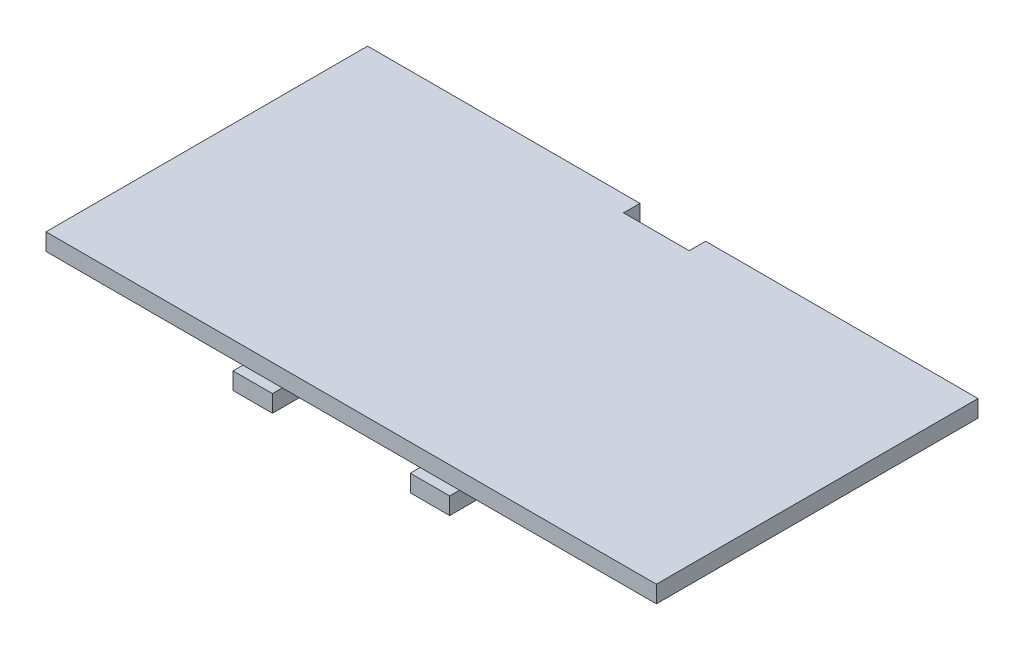
ISO-10303-21;
HEADER;
FILE_DESCRIPTION(('STEP AP214'),'2;1');
FILE_NAME('part.step','',(''),(''),'','','');
FILE_SCHEMA(('AUTOMOTIVE_DESIGN { 1 0 10303 214 1 1 1 1 }'));
ENDSEC;
DATA;
#1=APPLICATION_CONTEXT('core data for automotive mechanical design processes');
#2=APPLICATION_PROTOCOL_DEFINITION('international standard','automotive_design',2000,#1);
#3=PRODUCT_CONTEXT('',#1,'mechanical');
#4=PRODUCT('Part','Part','',(#3));
#5=PRODUCT_RELATED_PRODUCT_CATEGORY('part','',(#4));
#6=PRODUCT_DEFINITION_FORMATION('','',#4);
#7=PRODUCT_DEFINITION_CONTEXT('part definition',#1,'design');
#8=PRODUCT_DEFINITION('design','',#6,#7);
#9=PRODUCT_DEFINITION_SHAPE('','',#8);
#10=(LENGTH_UNIT() NAMED_UNIT(*) SI_UNIT(.MILLI.,.METRE.));
#11=(NAMED_UNIT(*) PLANE_ANGLE_UNIT() SI_UNIT($,.RADIAN.));
#12=(NAMED_UNIT(*) SI_UNIT($,.STERADIAN.) SOLID_ANGLE_UNIT());
#13=UNCERTAINTY_MEASURE_WITH_UNIT(LENGTH_MEASURE(1.E-05),#10,'distance_accuracy_value','');
#14=(GEOMETRIC_REPRESENTATION_CONTEXT(3) GLOBAL_UNCERTAINTY_ASSIGNED_CONTEXT((#13)) GLOBAL_UNIT_ASSIGNED_CONTEXT((#10,
#11,#12)) REPRESENTATION_CONTEXT('',''));
#15=CARTESIAN_POINT('',(0.,0.,0.));
#16=DIRECTION('',(0.,0.,1.));
#17=DIRECTION('',(1.,0.,0.));
#18=AXIS2_PLACEMENT_3D('',#15,#16,#17);
#19=CARTESIAN_POINT('',(0.,0.,0.));
#20=DIRECTION('',(0.,-1.,0.));
#21=DIRECTION('',(0.,0.,-1.));
#22=AXIS2_PLACEMENT_3D('',#19,#20,#21);
#23=PLANE('',#22);
#24=DIRECTION('',(1.,0.,0.));
#25=VECTOR('',#24,1.);
#26=CARTESIAN_POINT('',(-46.5,0.,24.5));
#27=LINE('',#26,#25);
#28=CARTESIAN_POINT('',(16.5,0.,24.5));
#29=VERTEX_POINT('',#28);
#30=CARTESIAN_POINT('',(46.5,0.,24.5));
#31=VERTEX_POINT('',#30);
#32=EDGE_CURVE('E263',#29,#31,#27,.T.);
#33=ORIENTED_EDGE('',*,*,#32,.F.);
#34=DIRECTION('',(0.,0.,1.));
#35=VECTOR('',#34,1.);
#36=CARTESIAN_POINT('',(16.5,0.,23.));
#37=LINE('',#36,#35);
#38=CARTESIAN_POINT('',(16.5,0.,21.5));
#39=VERTEX_POINT('',#38);
#40=EDGE_CURVE('E524',#39,#29,#37,.T.);
#41=ORIENTED_EDGE('',*,*,#40,.F.);
#42=DIRECTION('',(1.,0.,0.));
#43=VECTOR('',#42,1.);
#44=CARTESIAN_POINT('',(10.5,0.,21.5));
#45=LINE('',#44,#43);
#46=CARTESIAN_POINT('',(10.5,0.,21.5));
#47=VERTEX_POINT('',#46);
#48=EDGE_CURVE('E532',#47,#39,#45,.T.);
#49=ORIENTED_EDGE('',*,*,#48,.F.);
#50=DIRECTION('',(0.,0.,1.));
#51=VECTOR('',#50,1.);
#52=CARTESIAN_POINT('',(10.5,0.,0.));
#53=LINE('',#52,#51);
#54=CARTESIAN_POINT('',(10.5,0.,24.5));
#55=VERTEX_POINT('',#54);
#56=EDGE_CURVE('E11',#47,#55,#53,.T.);
#57=ORIENTED_EDGE('',*,*,#56,.T.);
#58=CARTESIAN_POINT('',(-10.5,0.,24.5));
#59=VERTEX_POINT('',#58);
#60=EDGE_CURVE('E300',#59,#55,#27,.T.);
#61=ORIENTED_EDGE('',*,*,#60,.F.);
#62=DIRECTION('',(0.,0.,1.));
#63=VECTOR('',#62,1.);
#64=CARTESIAN_POINT('',(-10.5,0.,23.));
#65=LINE('',#64,#63);
#66=CARTESIAN_POINT('',(-10.5,0.,21.5));
#67=VERTEX_POINT('',#66);
#68=EDGE_CURVE('E197',#67,#59,#65,.T.);
#69=ORIENTED_EDGE('',*,*,#68,.F.);
#70=DIRECTION('',(1.,0.,0.));
#71=VECTOR('',#70,1.);
#72=CARTESIAN_POINT('',(-16.5,0.,21.5));
#73=LINE('',#72,#71);
#74=CARTESIAN_POINT('',(-16.5,0.,21.5));
#75=VERTEX_POINT('',#74);
#76=EDGE_CURVE('E55',#75,#67,#73,.T.);
#77=ORIENTED_EDGE('',*,*,#76,.F.);
#78=DIRECTION('',(0.,0.,-1.));
#79=VECTOR('',#78,1.);
#80=CARTESIAN_POINT('',(-16.5,0.,23.));
#81=LINE('',#80,#79);
#82=CARTESIAN_POINT('',(-16.5,0.,24.5));
#83=VERTEX_POINT('',#82);
#84=EDGE_CURVE('E40',#83,#75,#81,.T.);
#85=ORIENTED_EDGE('',*,*,#84,.F.);
#86=CARTESIAN_POINT('',(-46.5,0.,24.5));
#87=VERTEX_POINT('',#86);
#88=EDGE_CURVE('E246',#87,#83,#27,.T.);
#89=ORIENTED_EDGE('',*,*,#88,.F.);
#90=DIRECTION('',(0.,0.,1.));
#91=VECTOR('',#90,1.);
#92=CARTESIAN_POINT('',(-46.5,0.,24.5));
#93=LINE('',#92,#91);
#94=CARTESIAN_POINT('',(-46.5,0.,-24.5));
#95=VERTEX_POINT('',#94);
#96=EDGE_CURVE('E261',#95,#87,#93,.T.);
#97=ORIENTED_EDGE('',*,*,#96,.F.);
#98=DIRECTION('',(-1.,0.,0.));
#99=VECTOR('',#98,1.);
#100=CARTESIAN_POINT('',(-46.5,0.,-24.5));
#101=LINE('',#100,#99);
#102=CARTESIAN_POINT('',(-5.,0.,-24.5));
#103=VERTEX_POINT('',#102);
#104=EDGE_CURVE('E257',#103,#95,#101,.T.);
#105=ORIENTED_EDGE('',*,*,#104,.F.);
#106=DIRECTION('',(0.,0.,1.));
#107=VECTOR('',#106,1.);
#108=CARTESIAN_POINT('',(-5.,0.,-24.5));
#109=LINE('',#108,#107);
#110=CARTESIAN_POINT('',(-5.,0.,-22.));
#111=VERTEX_POINT('',#110);
#112=EDGE_CURVE('E216',#103,#111,#109,.T.);
#113=ORIENTED_EDGE('',*,*,#112,.T.);
#114=DIRECTION('',(1.,0.,0.));
#115=VECTOR('',#114,1.);
#116=CARTESIAN_POINT('',(-5.,0.,-22.));
#117=LINE('',#116,#115);
#118=CARTESIAN_POINT('',(5.,0.,-22.));
#119=VERTEX_POINT('',#118);
#120=EDGE_CURVE('E219',#111,#119,#117,.T.);
#121=ORIENTED_EDGE('',*,*,#120,.T.);
#122=DIRECTION('',(0.,0.,-1.));
#123=VECTOR('',#122,1.);
#124=CARTESIAN_POINT('',(5.,0.,-24.5));
#125=LINE('',#124,#123);
#126=CARTESIAN_POINT('',(5.,0.,-24.5));
#127=VERTEX_POINT('',#126);
#128=EDGE_CURVE('E223',#119,#127,#125,.T.);
#129=ORIENTED_EDGE('',*,*,#128,.T.);
#130=CARTESIAN_POINT('',(46.5,0.,-24.5));
#131=VERTEX_POINT('',#130);
#132=EDGE_CURVE('E258',#131,#127,#101,.T.);
#133=ORIENTED_EDGE('',*,*,#132,.F.);
#134=DIRECTION('',(0.,0.,-1.));
#135=VECTOR('',#134,1.);
#136=CARTESIAN_POINT('',(46.5,0.,24.5));
#137=LINE('',#136,#135);
#138=EDGE_CURVE('E235',#31,#131,#137,.T.);
#139=ORIENTED_EDGE('',*,*,#138,.F.);
#140=EDGE_LOOP('',(#33,#41,#49,#57,#61,#69,#77,#85,#89,#97,#105,#113,#121,#129,#133,#139));
#141=FACE_BOUND('',#140,.T.);
#142=ADVANCED_FACE('F32',(#141),#23,.T.);
#143=CARTESIAN_POINT('',(-46.5,2.6,-24.5));
#144=DIRECTION('',(0.,0.,1.));
#145=DIRECTION('',(1.,0.,0.));
#146=AXIS2_PLACEMENT_3D('',#143,#144,#145);
#147=PLANE('',#146);
#148=DIRECTION('',(-1.,0.,0.));
#149=VECTOR('',#148,1.);
#150=CARTESIAN_POINT('',(-46.5,2.6,-24.5));
#151=LINE('',#150,#149);
#152=CARTESIAN_POINT('',(-5.,2.6,-24.5));
#153=VERTEX_POINT('',#152);
#154=CARTESIAN_POINT('',(-46.5,2.6,-24.5));
#155=VERTEX_POINT('',#154);
#156=EDGE_CURVE('E245',#153,#155,#151,.T.);
#157=ORIENTED_EDGE('',*,*,#156,.F.);
#158=DIRECTION('',(0.,1.,0.));
#159=VECTOR('',#158,1.);
#160=CARTESIAN_POINT('',(-5.,0.,-24.5));
#161=LINE('',#160,#159);
#162=EDGE_CURVE('E233',#103,#153,#161,.T.);
#163=ORIENTED_EDGE('',*,*,#162,.F.);
#164=ORIENTED_EDGE('',*,*,#104,.T.);
#165=DIRECTION('',(0.,-1.,0.));
#166=VECTOR('',#165,1.);
#167=CARTESIAN_POINT('',(-46.5,2.6,-24.5));
#168=LINE('',#167,#166);
#169=EDGE_CURVE('E272',#155,#95,#168,.T.);
#170=ORIENTED_EDGE('',*,*,#169,.F.);
#171=EDGE_LOOP('',(#157,#163,#164,#170));
#172=FACE_BOUND('',#171,.T.);
#173=ADVANCED_FACE('F326',(#172),#147,.F.);
#174=CARTESIAN_POINT('',(46.5,2.6,24.5));
#175=DIRECTION('',(-1.,0.,0.));
#176=DIRECTION('',(0.,0.,1.));
#177=AXIS2_PLACEMENT_3D('',#174,#175,#176);
#178=PLANE('',#177);
#179=ORIENTED_EDGE('',*,*,#138,.T.);
#180=DIRECTION('',(0.,-1.,0.));
#181=VECTOR('',#180,1.);
#182=CARTESIAN_POINT('',(46.5,2.6,-24.5));
#183=LINE('',#182,#181);
#184=CARTESIAN_POINT('',(46.5,2.6,-24.5));
#185=VERTEX_POINT('',#184);
#186=EDGE_CURVE('E274',#185,#131,#183,.T.);
#187=ORIENTED_EDGE('',*,*,#186,.F.);
#188=DIRECTION('',(0.,0.,-1.));
#189=VECTOR('',#188,1.);
#190=CARTESIAN_POINT('',(46.5,2.6,24.5));
#191=LINE('',#190,#189);
#192=CARTESIAN_POINT('',(46.5,2.6,24.5));
#193=VERTEX_POINT('',#192);
#194=EDGE_CURVE('E242',#193,#185,#191,.T.);
#195=ORIENTED_EDGE('',*,*,#194,.F.);
#196=DIRECTION('',(0.,-1.,0.));
#197=VECTOR('',#196,1.);
#198=CARTESIAN_POINT('',(46.5,2.6,24.5));
#199=LINE('',#198,#197);
#200=EDGE_CURVE('E254',#193,#31,#199,.T.);
#201=ORIENTED_EDGE('',*,*,#200,.T.);
#202=EDGE_LOOP('',(#179,#187,#195,#201));
#203=FACE_BOUND('',#202,.T.);
#204=ADVANCED_FACE('F34',(#203),#178,.F.);
#205=ORIENTED_EDGE('',*,*,#132,.T.);
#206=DIRECTION('',(0.,1.,0.));
#207=VECTOR('',#206,1.);
#208=CARTESIAN_POINT('',(5.,0.,-24.5));
#209=LINE('',#208,#207);
#210=CARTESIAN_POINT('',(5.,2.6,-24.5));
#211=VERTEX_POINT('',#210);
#212=EDGE_CURVE('E236',#127,#211,#209,.T.);
#213=ORIENTED_EDGE('',*,*,#212,.T.);
#214=EDGE_CURVE('E247',#185,#211,#151,.T.);
#215=ORIENTED_EDGE('',*,*,#214,.F.);
#216=ORIENTED_EDGE('',*,*,#186,.T.);
#217=EDGE_LOOP('',(#205,#213,#215,#216));
#218=FACE_BOUND('',#217,.T.);
#219=ADVANCED_FACE('F311',(#218),#147,.F.);
#220=CARTESIAN_POINT('',(-46.5,2.6,24.5));
#221=DIRECTION('',(1.,0.,0.));
#222=DIRECTION('',(0.,0.,-1.));
#223=AXIS2_PLACEMENT_3D('',#220,#221,#222);
#224=PLANE('',#223);
#225=ORIENTED_EDGE('',*,*,#96,.T.);
#226=DIRECTION('',(0.,-1.,0.));
#227=VECTOR('',#226,1.);
#228=CARTESIAN_POINT('',(-46.5,2.6,24.5));
#229=LINE('',#228,#227);
#230=CARTESIAN_POINT('',(-46.5,2.6,24.5));
#231=VERTEX_POINT('',#230);
#232=EDGE_CURVE('E269',#231,#87,#229,.T.);
#233=ORIENTED_EDGE('',*,*,#232,.F.);
#234=DIRECTION('',(0.,0.,1.));
#235=VECTOR('',#234,1.);
#236=CARTESIAN_POINT('',(-46.5,2.6,24.5));
#237=LINE('',#236,#235);
#238=EDGE_CURVE('E250',#155,#231,#237,.T.);
#239=ORIENTED_EDGE('',*,*,#238,.F.);
#240=ORIENTED_EDGE('',*,*,#169,.T.);
#241=EDGE_LOOP('',(#225,#233,#239,#240));
#242=FACE_BOUND('',#241,.T.);
#243=ADVANCED_FACE('F322',(#242),#224,.F.);
#244=CARTESIAN_POINT('',(-46.5,2.6,24.5));
#245=DIRECTION('',(0.,0.,-1.));
#246=DIRECTION('',(-1.,0.,0.));
#247=AXIS2_PLACEMENT_3D('',#244,#245,#246);
#248=PLANE('',#247);
#249=ORIENTED_EDGE('',*,*,#88,.T.);
#250=EDGE_CURVE('E266',#83,#59,#27,.T.);
#251=ORIENTED_EDGE('',*,*,#250,.T.);
#252=ORIENTED_EDGE('',*,*,#60,.T.);
#253=EDGE_CURVE('E301',#55,#29,#27,.T.);
#254=ORIENTED_EDGE('',*,*,#253,.T.);
#255=ORIENTED_EDGE('',*,*,#32,.T.);
#256=ORIENTED_EDGE('',*,*,#200,.F.);
#257=DIRECTION('',(1.,0.,0.));
#258=VECTOR('',#257,1.);
#259=CARTESIAN_POINT('',(-46.5,2.6,24.5));
#260=LINE('',#259,#258);
#261=EDGE_CURVE('E252',#231,#193,#260,.T.);
#262=ORIENTED_EDGE('',*,*,#261,.F.);
#263=ORIENTED_EDGE('',*,*,#232,.T.);
#264=EDGE_LOOP('',(#249,#251,#252,#254,#255,#256,#262,#263));
#265=FACE_BOUND('',#264,.T.);
#266=ADVANCED_FACE('F305',(#265),#248,.F.);
#267=CARTESIAN_POINT('',(0.,2.6,0.));
#268=DIRECTION('',(0.,-1.,0.));
#269=DIRECTION('',(0.,0.,-1.));
#270=AXIS2_PLACEMENT_3D('',#267,#268,#269);
#271=PLANE('',#270);
#272=DIRECTION('',(1.,0.,0.));
#273=VECTOR('',#272,1.);
#274=CARTESIAN_POINT('',(-5.,2.6,-22.));
#275=LINE('',#274,#273);
#276=CARTESIAN_POINT('',(-5.,2.6,-22.));
#277=VERTEX_POINT('',#276);
#278=CARTESIAN_POINT('',(5.,2.6,-22.));
#279=VERTEX_POINT('',#278);
#280=EDGE_CURVE('E229',#277,#279,#275,.T.);
#281=ORIENTED_EDGE('',*,*,#280,.F.);
#282=DIRECTION('',(0.,0.,1.));
#283=VECTOR('',#282,1.);
#284=CARTESIAN_POINT('',(-5.,2.6,-24.5));
#285=LINE('',#284,#283);
#286=EDGE_CURVE('E215',#153,#277,#285,.T.);
#287=ORIENTED_EDGE('',*,*,#286,.F.);
#288=ORIENTED_EDGE('',*,*,#156,.T.);
#289=ORIENTED_EDGE('',*,*,#238,.T.);
#290=ORIENTED_EDGE('',*,*,#261,.T.);
#291=ORIENTED_EDGE('',*,*,#194,.T.);
#292=ORIENTED_EDGE('',*,*,#214,.T.);
#293=DIRECTION('',(0.,0.,-1.));
#294=VECTOR('',#293,1.);
#295=CARTESIAN_POINT('',(5.,2.6,-24.5));
#296=LINE('',#295,#294);
#297=EDGE_CURVE('E220',#279,#211,#296,.T.);
#298=ORIENTED_EDGE('',*,*,#297,.F.);
#299=EDGE_LOOP('',(#281,#287,#288,#289,#290,#291,#292,#298));
#300=FACE_BOUND('',#299,.T.);
#301=ADVANCED_FACE('F316',(#300),#271,.F.);
#302=CARTESIAN_POINT('',(-5.,0.,-24.5));
#303=DIRECTION('',(-1.,0.,0.));
#304=DIRECTION('',(0.,0.,1.));
#305=AXIS2_PLACEMENT_3D('',#302,#303,#304);
#306=PLANE('',#305);
#307=ORIENTED_EDGE('',*,*,#286,.T.);
#308=DIRECTION('',(0.,1.,0.));
#309=VECTOR('',#308,1.);
#310=CARTESIAN_POINT('',(-5.,0.,-22.));
#311=LINE('',#310,#309);
#312=EDGE_CURVE('E226',#111,#277,#311,.T.);
#313=ORIENTED_EDGE('',*,*,#312,.F.);
#314=ORIENTED_EDGE('',*,*,#112,.F.);
#315=ORIENTED_EDGE('',*,*,#162,.T.);
#316=EDGE_LOOP('',(#307,#313,#314,#315));
#317=FACE_BOUND('',#316,.T.);
#318=ADVANCED_FACE('F330',(#317),#306,.F.);
#319=CARTESIAN_POINT('',(5.,0.,-24.5));
#320=DIRECTION('',(1.,0.,0.));
#321=DIRECTION('',(0.,0.,-1.));
#322=AXIS2_PLACEMENT_3D('',#319,#320,#321);
#323=PLANE('',#322);
#324=ORIENTED_EDGE('',*,*,#297,.T.);
#325=ORIENTED_EDGE('',*,*,#212,.F.);
#326=ORIENTED_EDGE('',*,*,#128,.F.);
#327=DIRECTION('',(0.,1.,0.));
#328=VECTOR('',#327,1.);
#329=CARTESIAN_POINT('',(5.,0.,-22.));
#330=LINE('',#329,#328);
#331=EDGE_CURVE('E239',#119,#279,#330,.T.);
#332=ORIENTED_EDGE('',*,*,#331,.T.);
#333=EDGE_LOOP('',(#324,#325,#326,#332));
#334=FACE_BOUND('',#333,.T.);
#335=ADVANCED_FACE('F335',(#334),#323,.F.);
#336=CARTESIAN_POINT('',(-5.,0.,-22.));
#337=DIRECTION('',(0.,0.,1.));
#338=DIRECTION('',(1.,0.,0.));
#339=AXIS2_PLACEMENT_3D('',#336,#337,#338);
#340=PLANE('',#339);
#341=ORIENTED_EDGE('',*,*,#280,.T.);
#342=ORIENTED_EDGE('',*,*,#331,.F.);
#343=ORIENTED_EDGE('',*,*,#120,.F.);
#344=ORIENTED_EDGE('',*,*,#312,.T.);
#345=EDGE_LOOP('',(#341,#342,#343,#344));
#346=FACE_BOUND('',#345,.T.);
#347=ADVANCED_FACE('F333',(#346),#340,.F.);
#348=CARTESIAN_POINT('',(-16.5,-2.6,21.5));
#349=DIRECTION('',(0.,0.,1.));
#350=DIRECTION('',(1.,0.,0.));
#351=AXIS2_PLACEMENT_3D('',#348,#349,#350);
#352=PLANE('',#351);
#353=ORIENTED_EDGE('',*,*,#76,.T.);
#354=DIRECTION('',(0.,1.,0.));
#355=VECTOR('',#354,1.);
#356=CARTESIAN_POINT('',(-10.5,-2.6,21.5));
#357=LINE('',#356,#355);
#358=CARTESIAN_POINT('',(-10.5,-2.6,21.5));
#359=VERTEX_POINT('',#358);
#360=EDGE_CURVE('E209',#359,#67,#357,.T.);
#361=ORIENTED_EDGE('',*,*,#360,.F.);
#362=DIRECTION('',(1.,0.,0.));
#363=VECTOR('',#362,1.);
#364=CARTESIAN_POINT('',(-16.5,-2.6,21.5));
#365=LINE('',#364,#363);
#366=CARTESIAN_POINT('',(-16.5,-2.6,21.5));
#367=VERTEX_POINT('',#366);
#368=EDGE_CURVE('E188',#367,#359,#365,.T.);
#369=ORIENTED_EDGE('',*,*,#368,.F.);
#370=DIRECTION('',(0.,1.,0.));
#371=VECTOR('',#370,1.);
#372=CARTESIAN_POINT('',(-16.5,-2.6,21.5));
#373=LINE('',#372,#371);
#374=EDGE_CURVE('E212',#367,#75,#373,.T.);
#375=ORIENTED_EDGE('',*,*,#374,.T.);
#376=EDGE_LOOP('',(#353,#361,#369,#375));
#377=FACE_BOUND('',#376,.T.);
#378=ADVANCED_FACE('F284',(#377),#352,.F.);
#379=CARTESIAN_POINT('',(-10.5,-2.6,23.));
#380=DIRECTION('',(-1.,0.,0.));
#381=DIRECTION('',(0.,0.,1.));
#382=AXIS2_PLACEMENT_3D('',#379,#380,#381);
#383=PLANE('',#382);
#384=ORIENTED_EDGE('',*,*,#68,.T.);
#385=CARTESIAN_POINT('',(-10.5,0.,26.));
#386=VERTEX_POINT('',#385);
#387=EDGE_CURVE('E179',#59,#386,#65,.T.);
#388=ORIENTED_EDGE('',*,*,#387,.T.);
#389=DIRECTION('',(0.,1.,0.));
#390=VECTOR('',#389,1.);
#391=CARTESIAN_POINT('',(-10.5,-2.6,26.));
#392=LINE('',#391,#390);
#393=CARTESIAN_POINT('',(-10.5,-2.6,26.));
#394=VERTEX_POINT('',#393);
#395=EDGE_CURVE('E206',#394,#386,#392,.T.);
#396=ORIENTED_EDGE('',*,*,#395,.F.);
#397=DIRECTION('',(0.,0.,1.));
#398=VECTOR('',#397,1.);
#399=CARTESIAN_POINT('',(-10.5,-2.6,21.5));
#400=LINE('',#399,#398);
#401=EDGE_CURVE('E191',#359,#394,#400,.T.);
#402=ORIENTED_EDGE('',*,*,#401,.F.);
#403=ORIENTED_EDGE('',*,*,#360,.T.);
#404=EDGE_LOOP('',(#384,#388,#396,#402,#403));
#405=FACE_BOUND('',#404,.T.);
#406=ADVANCED_FACE('F414',(#405),#383,.F.);
#407=CARTESIAN_POINT('',(-16.5,-2.6,26.));
#408=DIRECTION('',(0.,0.,-1.));
#409=DIRECTION('',(-1.,0.,0.));
#410=AXIS2_PLACEMENT_3D('',#407,#408,#409);
#411=PLANE('',#410);
#412=DIRECTION('',(-1.,0.,0.));
#413=VECTOR('',#412,1.);
#414=CARTESIAN_POINT('',(-16.5,0.,26.));
#415=LINE('',#414,#413);
#416=CARTESIAN_POINT('',(-16.5,0.,26.));
#417=VERTEX_POINT('',#416);
#418=EDGE_CURVE('E200',#386,#417,#415,.T.);
#419=ORIENTED_EDGE('',*,*,#418,.T.);
#420=DIRECTION('',(0.,1.,0.));
#421=VECTOR('',#420,1.);
#422=CARTESIAN_POINT('',(-16.5,-2.6,26.));
#423=LINE('',#422,#421);
#424=CARTESIAN_POINT('',(-16.5,-2.6,26.));
#425=VERTEX_POINT('',#424);
#426=EDGE_CURVE('E195',#425,#417,#423,.T.);
#427=ORIENTED_EDGE('',*,*,#426,.F.);
#428=DIRECTION('',(-1.,0.,0.));
#429=VECTOR('',#428,1.);
#430=CARTESIAN_POINT('',(-16.5,-2.6,26.));
#431=LINE('',#430,#429);
#432=EDGE_CURVE('E193',#394,#425,#431,.T.);
#433=ORIENTED_EDGE('',*,*,#432,.F.);
#434=ORIENTED_EDGE('',*,*,#395,.T.);
#435=EDGE_LOOP('',(#419,#427,#433,#434));
#436=FACE_BOUND('',#435,.T.);
#437=ADVANCED_FACE('F423',(#436),#411,.F.);
#438=CARTESIAN_POINT('',(-16.5,-2.6,23.));
#439=DIRECTION('',(1.,0.,0.));
#440=DIRECTION('',(0.,0.,-1.));
#441=AXIS2_PLACEMENT_3D('',#438,#439,#440);
#442=PLANE('',#441);
#443=EDGE_CURVE('E189',#417,#83,#81,.T.);
#444=ORIENTED_EDGE('',*,*,#443,.T.);
#445=ORIENTED_EDGE('',*,*,#84,.T.);
#446=ORIENTED_EDGE('',*,*,#374,.F.);
#447=DIRECTION('',(0.,0.,-1.));
#448=VECTOR('',#447,1.);
#449=CARTESIAN_POINT('',(-16.5,-2.6,23.));
#450=LINE('',#449,#448);
#451=EDGE_CURVE('E185',#425,#367,#450,.T.);
#452=ORIENTED_EDGE('',*,*,#451,.F.);
#453=ORIENTED_EDGE('',*,*,#426,.T.);
#454=EDGE_LOOP('',(#444,#445,#446,#452,#453));
#455=FACE_BOUND('',#454,.T.);
#456=ADVANCED_FACE('F280',(#455),#442,.F.);
#457=CARTESIAN_POINT('',(0.,-2.6,0.));
#458=DIRECTION('',(0.,-1.,0.));
#459=DIRECTION('',(0.,0.,-1.));
#460=AXIS2_PLACEMENT_3D('',#457,#458,#459);
#461=PLANE('',#460);
#462=ORIENTED_EDGE('',*,*,#451,.T.);
#463=ORIENTED_EDGE('',*,*,#368,.T.);
#464=ORIENTED_EDGE('',*,*,#401,.T.);
#465=ORIENTED_EDGE('',*,*,#432,.T.);
#466=EDGE_LOOP('',(#462,#463,#464,#465));
#467=FACE_BOUND('',#466,.T.);
#468=ADVANCED_FACE('F288',(#467),#461,.T.);
#469=CARTESIAN_POINT('',(0.,0.,0.));
#470=DIRECTION('',(0.,-1.,0.));
#471=DIRECTION('',(0.,0.,-1.));
#472=AXIS2_PLACEMENT_3D('',#469,#470,#471);
#473=PLANE('',#472);
#474=ORIENTED_EDGE('',*,*,#250,.F.);
#475=ORIENTED_EDGE('',*,*,#443,.F.);
#476=ORIENTED_EDGE('',*,*,#418,.F.);
#477=ORIENTED_EDGE('',*,*,#387,.F.);
#478=EDGE_LOOP('',(#474,#475,#476,#477));
#479=FACE_BOUND('',#478,.T.);
#480=ADVANCED_FACE('F295',(#479),#473,.F.);
#481=CARTESIAN_POINT('',(0.,0.,0.));
#482=DIRECTION('',(0.,-1.,0.));
#483=DIRECTION('',(0.,0.,-1.));
#484=AXIS2_PLACEMENT_3D('',#481,#482,#483);
#485=PLANE('',#484);
#486=CARTESIAN_POINT('',(16.5,0.,26.));
#487=VERTEX_POINT('',#486);
#488=EDGE_CURVE('E531',#29,#487,#37,.T.);
#489=ORIENTED_EDGE('',*,*,#488,.F.);
#490=ORIENTED_EDGE('',*,*,#253,.F.);
#491=DIRECTION('',(0.,0.,-1.));
#492=VECTOR('',#491,1.);
#493=CARTESIAN_POINT('',(10.5,0.,23.));
#494=LINE('',#493,#492);
#495=CARTESIAN_POINT('',(10.5,0.,26.));
#496=VERTEX_POINT('',#495);
#497=EDGE_CURVE('E47',#496,#55,#494,.T.);
#498=ORIENTED_EDGE('',*,*,#497,.F.);
#499=DIRECTION('',(-1.,0.,0.));
#500=VECTOR('',#499,1.);
#501=CARTESIAN_POINT('',(10.5,0.,26.));
#502=LINE('',#501,#500);
#503=EDGE_CURVE('E521',#487,#496,#502,.T.);
#504=ORIENTED_EDGE('',*,*,#503,.F.);
#505=EDGE_LOOP('',(#489,#490,#498,#504));
#506=FACE_BOUND('',#505,.T.);
#507=ADVANCED_FACE('F458',(#506),#485,.F.);
#508=CARTESIAN_POINT('',(10.5,-2.6,21.5));
#509=DIRECTION('',(0.,0.,1.));
#510=DIRECTION('',(1.,0.,0.));
#511=AXIS2_PLACEMENT_3D('',#508,#509,#510);
#512=PLANE('',#511);
#513=ORIENTED_EDGE('',*,*,#48,.T.);
#514=DIRECTION('',(0.,1.,0.));
#515=VECTOR('',#514,1.);
#516=CARTESIAN_POINT('',(16.5,-2.6,21.5));
#517=LINE('',#516,#515);
#518=CARTESIAN_POINT('',(16.5,-2.6,21.5));
#519=VERTEX_POINT('',#518);
#520=EDGE_CURVE('E165',#519,#39,#517,.T.);
#521=ORIENTED_EDGE('',*,*,#520,.F.);
#522=DIRECTION('',(1.,0.,0.));
#523=VECTOR('',#522,1.);
#524=CARTESIAN_POINT('',(10.5,-2.6,21.5));
#525=LINE('',#524,#523);
#526=CARTESIAN_POINT('',(10.5,-2.6,21.5));
#527=VERTEX_POINT('',#526);
#528=EDGE_CURVE('E158',#527,#519,#525,.T.);
#529=ORIENTED_EDGE('',*,*,#528,.F.);
#530=DIRECTION('',(0.,1.,0.));
#531=VECTOR('',#530,1.);
#532=CARTESIAN_POINT('',(10.5,-2.6,21.5));
#533=LINE('',#532,#531);
#534=EDGE_CURVE('E162',#527,#47,#533,.T.);
#535=ORIENTED_EDGE('',*,*,#534,.T.);
#536=EDGE_LOOP('',(#513,#521,#529,#535));
#537=FACE_BOUND('',#536,.T.);
#538=ADVANCED_FACE('F160',(#537),#512,.F.);
#539=CARTESIAN_POINT('',(16.5,-2.6,23.));
#540=DIRECTION('',(-1.,0.,0.));
#541=DIRECTION('',(0.,0.,1.));
#542=AXIS2_PLACEMENT_3D('',#539,#540,#541);
#543=PLANE('',#542);
#544=ORIENTED_EDGE('',*,*,#40,.T.);
#545=ORIENTED_EDGE('',*,*,#488,.T.);
#546=DIRECTION('',(0.,1.,0.));
#547=VECTOR('',#546,1.);
#548=CARTESIAN_POINT('',(16.5,-2.6,26.));
#549=LINE('',#548,#547);
#550=CARTESIAN_POINT('',(16.5,-2.6,26.));
#551=VERTEX_POINT('',#550);
#552=EDGE_CURVE('E181',#551,#487,#549,.T.);
#553=ORIENTED_EDGE('',*,*,#552,.F.);
#554=DIRECTION('',(0.,0.,1.));
#555=VECTOR('',#554,1.);
#556=CARTESIAN_POINT('',(16.5,-2.6,21.5));
#557=LINE('',#556,#555);
#558=EDGE_CURVE('E168',#519,#551,#557,.T.);
#559=ORIENTED_EDGE('',*,*,#558,.F.);
#560=ORIENTED_EDGE('',*,*,#520,.T.);
#561=EDGE_LOOP('',(#544,#545,#553,#559,#560));
#562=FACE_BOUND('',#561,.T.);
#563=ADVANCED_FACE('F476',(#562),#543,.F.);
#564=CARTESIAN_POINT('',(10.5,-2.6,26.));
#565=DIRECTION('',(0.,0.,-1.));
#566=DIRECTION('',(-1.,0.,0.));
#567=AXIS2_PLACEMENT_3D('',#564,#565,#566);
#568=PLANE('',#567);
#569=ORIENTED_EDGE('',*,*,#503,.T.);
#570=DIRECTION('',(0.,1.,0.));
#571=VECTOR('',#570,1.);
#572=CARTESIAN_POINT('',(10.5,-2.6,26.));
#573=LINE('',#572,#571);
#574=CARTESIAN_POINT('',(10.5,-2.6,26.));
#575=VERTEX_POINT('',#574);
#576=EDGE_CURVE('E522',#575,#496,#573,.T.);
#577=ORIENTED_EDGE('',*,*,#576,.F.);
#578=DIRECTION('',(-1.,0.,0.));
#579=VECTOR('',#578,1.);
#580=CARTESIAN_POINT('',(10.5,-2.6,26.));
#581=LINE('',#580,#579);
#582=EDGE_CURVE('E174',#551,#575,#581,.T.);
#583=ORIENTED_EDGE('',*,*,#582,.F.);
#584=ORIENTED_EDGE('',*,*,#552,.T.);
#585=EDGE_LOOP('',(#569,#577,#583,#584));
#586=FACE_BOUND('',#585,.T.);
#587=ADVANCED_FACE('F486',(#586),#568,.F.);
#588=CARTESIAN_POINT('',(10.5,-2.6,23.));
#589=DIRECTION('',(1.,0.,0.));
#590=DIRECTION('',(0.,0.,-1.));
#591=AXIS2_PLACEMENT_3D('',#588,#589,#590);
#592=PLANE('',#591);
#593=ORIENTED_EDGE('',*,*,#497,.T.);
#594=ORIENTED_EDGE('',*,*,#56,.F.);
#595=ORIENTED_EDGE('',*,*,#534,.F.);
#596=DIRECTION('',(0.,0.,-1.));
#597=VECTOR('',#596,1.);
#598=CARTESIAN_POINT('',(10.5,-2.6,23.));
#599=LINE('',#598,#597);
#600=EDGE_CURVE('E169',#575,#527,#599,.T.);
#601=ORIENTED_EDGE('',*,*,#600,.F.);
#602=ORIENTED_EDGE('',*,*,#576,.T.);
#603=EDGE_LOOP('',(#593,#594,#595,#601,#602));
#604=FACE_BOUND('',#603,.T.);
#605=ADVANCED_FACE('F177',(#604),#592,.F.);
#606=CARTESIAN_POINT('',(0.,-2.6,0.));
#607=DIRECTION('',(0.,-1.,0.));
#608=DIRECTION('',(0.,0.,-1.));
#609=AXIS2_PLACEMENT_3D('',#606,#607,#608);
#610=PLANE('',#609);
#611=ORIENTED_EDGE('',*,*,#600,.T.);
#612=ORIENTED_EDGE('',*,*,#528,.T.);
#613=ORIENTED_EDGE('',*,*,#558,.T.);
#614=ORIENTED_EDGE('',*,*,#582,.T.);
#615=EDGE_LOOP('',(#611,#612,#613,#614));
#616=FACE_BOUND('',#615,.T.);
#617=ADVANCED_FACE('F172',(#616),#610,.T.);
#618=CLOSED_SHELL('',(#142,#173,#204,#219,#243,#266,#301,#318,#335,#347,#378,#406,#437,#456,
#468,#480,#507,#538,#563,#587,#605,#617));
#619=MANIFOLD_SOLID_BREP('B2',#618);
#620=ADVANCED_BREP_SHAPE_REPRESENTATION('',(#18,#619),#14);
#621=SHAPE_DEFINITION_REPRESENTATION(#9,#620);
ENDSEC;
END-ISO-10303-21;
